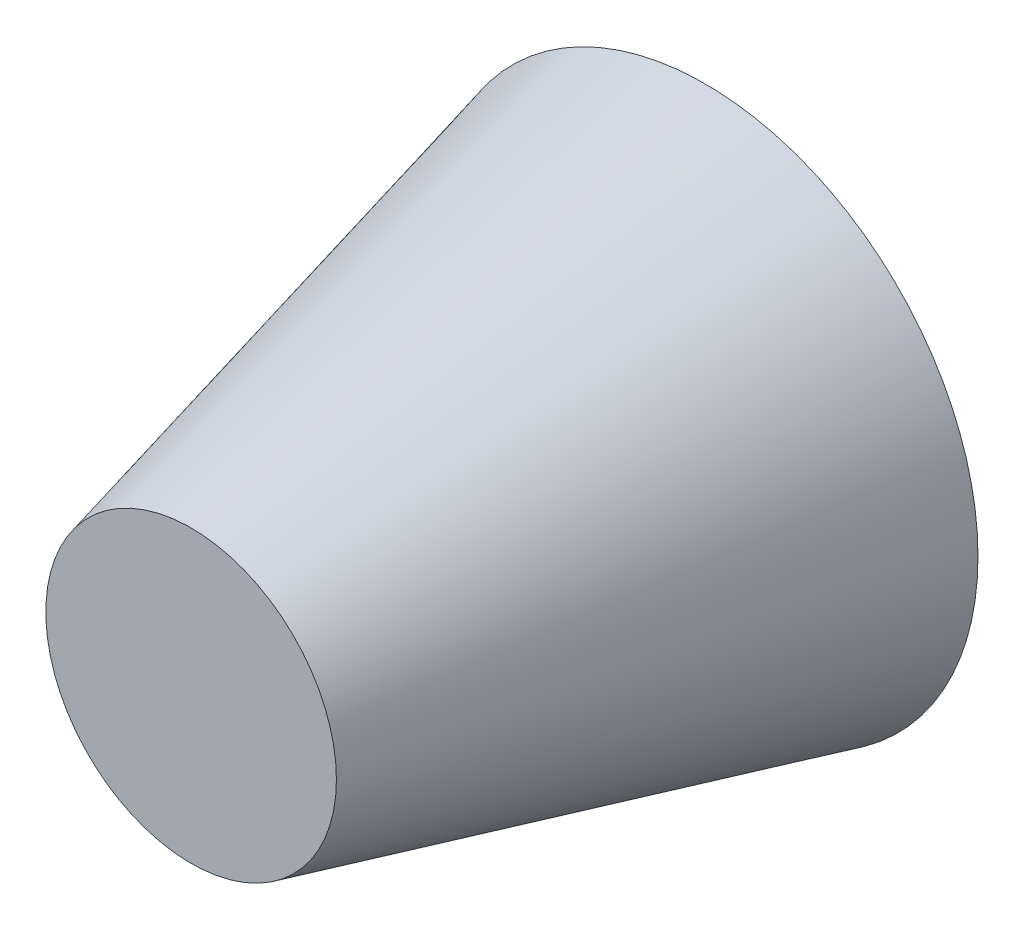
ISO-10303-21;
HEADER;
FILE_DESCRIPTION(('STEP AP214'),'2;1');
FILE_NAME('part.step','',(''),(''),'','','');
FILE_SCHEMA(('AUTOMOTIVE_DESIGN { 1 0 10303 214 1 1 1 1 }'));
ENDSEC;
DATA;
#1=APPLICATION_CONTEXT('core data for automotive mechanical design processes');
#2=APPLICATION_PROTOCOL_DEFINITION('international standard','automotive_design',2000,#1);
#3=PRODUCT_CONTEXT('',#1,'mechanical');
#4=PRODUCT('Part','Part','',(#3));
#5=PRODUCT_RELATED_PRODUCT_CATEGORY('part','',(#4));
#6=PRODUCT_DEFINITION_FORMATION('','',#4);
#7=PRODUCT_DEFINITION_CONTEXT('part definition',#1,'design');
#8=PRODUCT_DEFINITION('design','',#6,#7);
#9=PRODUCT_DEFINITION_SHAPE('','',#8);
#10=(LENGTH_UNIT() NAMED_UNIT(*) SI_UNIT(.MILLI.,.METRE.));
#11=(NAMED_UNIT(*) PLANE_ANGLE_UNIT() SI_UNIT($,.RADIAN.));
#12=(NAMED_UNIT(*) SI_UNIT($,.STERADIAN.) SOLID_ANGLE_UNIT());
#13=UNCERTAINTY_MEASURE_WITH_UNIT(LENGTH_MEASURE(1.E-05),#10,'distance_accuracy_value','');
#14=(GEOMETRIC_REPRESENTATION_CONTEXT(3) GLOBAL_UNCERTAINTY_ASSIGNED_CONTEXT((#13)) GLOBAL_UNIT_ASSIGNED_CONTEXT((#10,
#11,#12)) REPRESENTATION_CONTEXT('',''));
#15=CARTESIAN_POINT('',(0.,0.,0.));
#16=DIRECTION('',(0.,0.,1.));
#17=DIRECTION('',(1.,0.,0.));
#18=AXIS2_PLACEMENT_3D('',#15,#16,#17);
#19=CARTESIAN_POINT('',(0.,0.,0.));
#20=DIRECTION('',(0.,0.,1.));
#21=DIRECTION('',(1.,0.,0.));
#22=AXIS2_PLACEMENT_3D('',#19,#20,#21);
#23=PLANE('',#22);
#24=CARTESIAN_POINT('',(0.,0.,0.));
#25=DIRECTION('',(0.,0.,1.));
#26=DIRECTION('',(1.,0.,0.));
#27=AXIS2_PLACEMENT_3D('',#24,#25,#26);
#28=CIRCLE('',#27,6.1);
#29=CARTESIAN_POINT('',(6.1,0.,0.));
#30=VERTEX_POINT('',#29);
#31=EDGE_CURVE('E11',#30,#30,#28,.T.);
#32=ORIENTED_EDGE('',*,*,#31,.F.);
#33=EDGE_LOOP('',(#32));
#34=FACE_BOUND('',#33,.T.);
#35=ADVANCED_FACE('F37',(#34),#23,.F.);
#36=CARTESIAN_POINT('',(0.,0.,11.5));
#37=DIRECTION('',(0.,0.,1.));
#38=DIRECTION('',(1.,0.,0.));
#39=AXIS2_PLACEMENT_3D('',#36,#37,#38);
#40=PLANE('',#39);
#41=CARTESIAN_POINT('',(0.,0.,11.5));
#42=DIRECTION('',(0.,0.,1.));
#43=DIRECTION('',(1.,0.,0.));
#44=AXIS2_PLACEMENT_3D('',#41,#42,#43);
#45=CIRCLE('',#44,3.25);
#46=CARTESIAN_POINT('',(3.25,0.,11.5));
#47=VERTEX_POINT('',#46);
#48=EDGE_CURVE('E45',#47,#47,#45,.T.);
#49=ORIENTED_EDGE('',*,*,#48,.T.);
#50=EDGE_LOOP('',(#49));
#51=FACE_BOUND('',#50,.T.);
#52=ADVANCED_FACE('F69',(#51),#40,.T.);
#53=CARTESIAN_POINT('',(0.,0.,11.5));
#54=DIRECTION('',(0.,0.,-1.));
#55=DIRECTION('',(-1.,0.,0.));
#56=AXIS2_PLACEMENT_3D('',#53,#54,#55);
#57=CONICAL_SURFACE('',#56,3.25,0.242931583079466);
#58=ORIENTED_EDGE('',*,*,#48,.F.);
#59=EDGE_LOOP('',(#58));
#60=FACE_BOUND('',#59,.T.);
#61=ORIENTED_EDGE('',*,*,#31,.T.);
#62=EDGE_LOOP('',(#61));
#63=FACE_BOUND('',#62,.T.);
#64=ADVANCED_FACE('F77',(#60,#63),#57,.T.);
#65=CLOSED_SHELL('',(#35,#52,#64));
#66=MANIFOLD_SOLID_BREP('B2',#65);
#67=ADVANCED_BREP_SHAPE_REPRESENTATION('',(#18,#66),#14);
#68=SHAPE_DEFINITION_REPRESENTATION(#9,#67);
ENDSEC;
END-ISO-10303-21;
